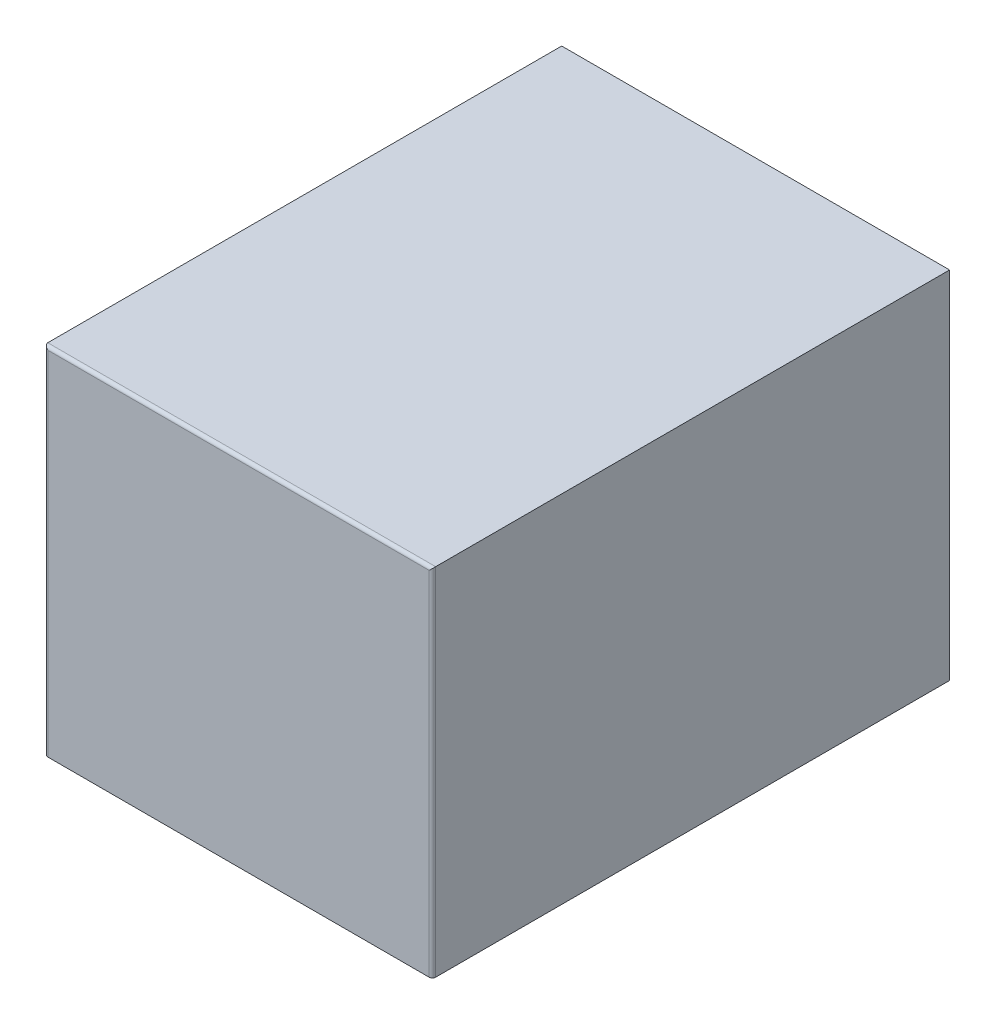
ISO-10303-21;
HEADER;
FILE_DESCRIPTION(('STEP AP214'),'2;1');
FILE_NAME('part.step','',(''),(''),'','','');
FILE_SCHEMA(('AUTOMOTIVE_DESIGN { 1 0 10303 214 1 1 1 1 }'));
ENDSEC;
DATA;
#1=APPLICATION_CONTEXT('core data for automotive mechanical design processes');
#2=APPLICATION_PROTOCOL_DEFINITION('international standard','automotive_design',2000,#1);
#3=PRODUCT_CONTEXT('',#1,'mechanical');
#4=PRODUCT('Part','Part','',(#3));
#5=PRODUCT_RELATED_PRODUCT_CATEGORY('part','',(#4));
#6=PRODUCT_DEFINITION_FORMATION('','',#4);
#7=PRODUCT_DEFINITION_CONTEXT('part definition',#1,'design');
#8=PRODUCT_DEFINITION('design','',#6,#7);
#9=PRODUCT_DEFINITION_SHAPE('','',#8);
#10=(LENGTH_UNIT() NAMED_UNIT(*) SI_UNIT(.MILLI.,.METRE.));
#11=(NAMED_UNIT(*) PLANE_ANGLE_UNIT() SI_UNIT($,.RADIAN.));
#12=(NAMED_UNIT(*) SI_UNIT($,.STERADIAN.) SOLID_ANGLE_UNIT());
#13=UNCERTAINTY_MEASURE_WITH_UNIT(LENGTH_MEASURE(1.E-05),#10,'distance_accuracy_value','');
#14=(GEOMETRIC_REPRESENTATION_CONTEXT(3) GLOBAL_UNCERTAINTY_ASSIGNED_CONTEXT((#13)) GLOBAL_UNIT_ASSIGNED_CONTEXT((#10,
#11,#12)) REPRESENTATION_CONTEXT('',''));
#15=CARTESIAN_POINT('',(0.,0.,0.));
#16=DIRECTION('',(0.,0.,1.));
#17=DIRECTION('',(1.,0.,0.));
#18=AXIS2_PLACEMENT_3D('',#15,#16,#17);
#19=CARTESIAN_POINT('',(0.,0.,3.));
#20=DIRECTION('',(0.,0.,-1.));
#21=DIRECTION('',(-1.,0.,0.));
#22=AXIS2_PLACEMENT_3D('',#19,#20,#21);
#23=PLANE('',#22);
#24=DIRECTION('',(0.,-1.,0.));
#25=VECTOR('',#24,1.);
#26=CARTESIAN_POINT('',(4.94217673369061,7.43294023362127,3.));
#27=LINE('',#26,#25);
#28=CARTESIAN_POINT('',(4.94217673369061,7.43294023362127,3.));
#29=VERTEX_POINT('',#28);
#30=CARTESIAN_POINT('',(4.94217673369061,1.30464108384491,3.));
#31=VERTEX_POINT('',#30);
#32=EDGE_CURVE('E180',#29,#31,#27,.T.);
#33=ORIENTED_EDGE('',*,*,#32,.T.);
#34=DIRECTION('',(-1.,0.,0.));
#35=VECTOR('',#34,1.);
#36=CARTESIAN_POINT('',(4.94217673369061,1.30464108384491,3.));
#37=LINE('',#36,#35);
#38=CARTESIAN_POINT('',(-5.20575949282078,1.30464108384491,3.));
#39=VERTEX_POINT('',#38);
#40=EDGE_CURVE('E183',#31,#39,#37,.T.);
#41=ORIENTED_EDGE('',*,*,#40,.T.);
#42=DIRECTION('',(0.,1.,0.));
#43=VECTOR('',#42,1.);
#44=CARTESIAN_POINT('',(-5.20575949282078,1.30464108384491,3.));
#45=LINE('',#44,#43);
#46=CARTESIAN_POINT('',(-5.20575949282078,7.43294023362127,3.));
#47=VERTEX_POINT('',#46);
#48=EDGE_CURVE('E187',#39,#47,#45,.T.);
#49=ORIENTED_EDGE('',*,*,#48,.T.);
#50=DIRECTION('',(0.597665098454604,0.801745863780568,0.));
#51=VECTOR('',#50,1.);
#52=CARTESIAN_POINT('',(-5.20575949282078,7.43294023362127,3.));
#53=LINE('',#52,#51);
#54=CARTESIAN_POINT('',(-3.40461063876465,9.8491155256478,3.));
#55=VERTEX_POINT('',#54);
#56=EDGE_CURVE('E190',#47,#55,#53,.T.);
#57=ORIENTED_EDGE('',*,*,#56,.T.);
#58=DIRECTION('',(1.,0.,0.));
#59=VECTOR('',#58,1.);
#60=CARTESIAN_POINT('',(-3.40461063876465,9.8491155256478,3.));
#61=LINE('',#60,#59);
#62=CARTESIAN_POINT('',(3.0092365000694,9.8491155256478,3.));
#63=VERTEX_POINT('',#62);
#64=EDGE_CURVE('E193',#55,#63,#61,.T.);
#65=ORIENTED_EDGE('',*,*,#64,.T.);
#66=DIRECTION('',(0.624695047554424,-0.780868809443031,0.));
#67=VECTOR('',#66,1.);
#68=CARTESIAN_POINT('',(3.0092365000694,9.8491155256478,3.));
#69=LINE('',#68,#67);
#70=EDGE_CURVE('E196',#63,#29,#69,.T.);
#71=ORIENTED_EDGE('',*,*,#70,.T.);
#72=EDGE_LOOP('',(#33,#41,#49,#57,#65,#71));
#73=FACE_BOUND('',#72,.T.);
#74=DIRECTION('',(1.,0.,0.));
#75=VECTOR('',#74,1.);
#76=CARTESIAN_POINT('',(3.14102787963448,7.28204634918754,3.));
#77=LINE('',#76,#75);
#78=CARTESIAN_POINT('',(-3.40461063876465,7.28204634918754,3.));
#79=VERTEX_POINT('',#78);
#80=CARTESIAN_POINT('',(3.14102787963448,7.28204634918754,3.));
#81=VERTEX_POINT('',#80);
#82=EDGE_CURVE('E472',#79,#81,#77,.T.);
#83=ORIENTED_EDGE('',*,*,#82,.F.);
#84=DIRECTION('',(0.,1.,0.));
#85=VECTOR('',#84,1.);
#86=CARTESIAN_POINT('',(-3.40461063876465,7.28204634918754,3.));
#87=LINE('',#86,#85);
#88=CARTESIAN_POINT('',(-3.40461063876465,3.4979479286905,3.));
#89=VERTEX_POINT('',#88);
#90=EDGE_CURVE('E172',#89,#79,#87,.T.);
#91=ORIENTED_EDGE('',*,*,#90,.F.);
#92=DIRECTION('',(-1.,0.,0.));
#93=VECTOR('',#92,1.);
#94=CARTESIAN_POINT('',(3.14102787963448,3.4979479286905,3.));
#95=LINE('',#94,#93);
#96=CARTESIAN_POINT('',(3.14102787963448,3.4979479286905,3.));
#97=VERTEX_POINT('',#96);
#98=EDGE_CURVE('E168',#97,#89,#95,.T.);
#99=ORIENTED_EDGE('',*,*,#98,.F.);
#100=DIRECTION('',(0.,-1.,0.));
#101=VECTOR('',#100,1.);
#102=CARTESIAN_POINT('',(3.14102787963448,7.28204634918754,3.));
#103=LINE('',#102,#101);
#104=EDGE_CURVE('E469',#81,#97,#103,.T.);
#105=ORIENTED_EDGE('',*,*,#104,.F.);
#106=EDGE_LOOP('',(#83,#91,#99,#105));
#107=FACE_BOUND('',#106,.T.);
#108=ADVANCED_FACE('F35',(#73,#107),#23,.T.);
#109=CARTESIAN_POINT('',(6.,11.,-8.));
#110=DIRECTION('',(-1.,0.,0.));
#111=DIRECTION('',(0.,0.,1.));
#112=AXIS2_PLACEMENT_3D('',#109,#110,#111);
#113=PLANE('',#112);
#114=DIRECTION('',(0.,0.,-1.));
#115=VECTOR('',#114,1.);
#116=CARTESIAN_POINT('',(6.,11.,-8.));
#117=LINE('',#116,#115);
#118=CARTESIAN_POINT('',(6.,11.,7.9));
#119=VERTEX_POINT('',#118);
#120=CARTESIAN_POINT('',(6.,11.,-8.));
#121=VERTEX_POINT('',#120);
#122=EDGE_CURVE('E229',#119,#121,#117,.T.);
#123=ORIENTED_EDGE('',*,*,#122,.F.);
#124=DIRECTION('',(0.,-1.,0.));
#125=VECTOR('',#124,1.);
#126=CARTESIAN_POINT('',(6.,11.,7.9));
#127=LINE('',#126,#125);
#128=CARTESIAN_POINT('',(6.,0.,7.9));
#129=VERTEX_POINT('',#128);
#130=EDGE_CURVE('E44',#119,#129,#127,.T.);
#131=ORIENTED_EDGE('',*,*,#130,.T.);
#132=DIRECTION('',(0.,0.,-1.));
#133=VECTOR('',#132,1.);
#134=CARTESIAN_POINT('',(6.,0.,-8.));
#135=LINE('',#134,#133);
#136=CARTESIAN_POINT('',(6.,0.,-8.));
#137=VERTEX_POINT('',#136);
#138=EDGE_CURVE('E218',#129,#137,#135,.T.);
#139=ORIENTED_EDGE('',*,*,#138,.T.);
#140=DIRECTION('',(0.,-1.,0.));
#141=VECTOR('',#140,1.);
#142=CARTESIAN_POINT('',(6.,11.,-8.));
#143=LINE('',#142,#141);
#144=EDGE_CURVE('E247',#121,#137,#143,.T.);
#145=ORIENTED_EDGE('',*,*,#144,.F.);
#146=EDGE_LOOP('',(#123,#131,#139,#145));
#147=FACE_BOUND('',#146,.T.);
#148=ADVANCED_FACE('F266',(#147),#113,.F.);
#149=CARTESIAN_POINT('',(-6.,11.,-8.));
#150=DIRECTION('',(0.,0.,1.));
#151=DIRECTION('',(1.,0.,0.));
#152=AXIS2_PLACEMENT_3D('',#149,#150,#151);
#153=PLANE('',#152);
#154=DIRECTION('',(-1.,0.,0.));
#155=VECTOR('',#154,1.);
#156=CARTESIAN_POINT('',(4.94217673369061,1.30464108384491,-8.));
#157=LINE('',#156,#155);
#158=CARTESIAN_POINT('',(4.94217673369061,1.30464108384491,-8.));
#159=VERTEX_POINT('',#158);
#160=CARTESIAN_POINT('',(-5.20575949282078,1.30464108384491,-8.));
#161=VERTEX_POINT('',#160);
#162=EDGE_CURVE('E202',#159,#161,#157,.T.);
#163=ORIENTED_EDGE('',*,*,#162,.F.);
#164=DIRECTION('',(0.,-1.,0.));
#165=VECTOR('',#164,1.);
#166=CARTESIAN_POINT('',(4.94217673369061,7.43294023362127,-8.));
#167=LINE('',#166,#165);
#168=CARTESIAN_POINT('',(4.94217673369061,7.43294023362127,-8.));
#169=VERTEX_POINT('',#168);
#170=EDGE_CURVE('E200',#169,#159,#167,.T.);
#171=ORIENTED_EDGE('',*,*,#170,.F.);
#172=DIRECTION('',(0.624695047554424,-0.780868809443031,0.));
#173=VECTOR('',#172,1.);
#174=CARTESIAN_POINT('',(3.0092365000694,9.8491155256478,-8.));
#175=LINE('',#174,#173);
#176=CARTESIAN_POINT('',(3.0092365000694,9.8491155256478,-8.));
#177=VERTEX_POINT('',#176);
#178=EDGE_CURVE('E184',#177,#169,#175,.T.);
#179=ORIENTED_EDGE('',*,*,#178,.F.);
#180=DIRECTION('',(1.,0.,0.));
#181=VECTOR('',#180,1.);
#182=CARTESIAN_POINT('',(-3.40461063876465,9.8491155256478,-8.));
#183=LINE('',#182,#181);
#184=CARTESIAN_POINT('',(-3.40461063876465,9.8491155256478,-8.));
#185=VERTEX_POINT('',#184);
#186=EDGE_CURVE('E211',#185,#177,#183,.T.);
#187=ORIENTED_EDGE('',*,*,#186,.F.);
#188=DIRECTION('',(0.597665098454604,0.801745863780568,0.));
#189=VECTOR('',#188,1.);
#190=CARTESIAN_POINT('',(-5.20575949282078,7.43294023362127,-8.));
#191=LINE('',#190,#189);
#192=CARTESIAN_POINT('',(-5.20575949282078,7.43294023362127,-8.));
#193=VERTEX_POINT('',#192);
#194=EDGE_CURVE('E208',#193,#185,#191,.T.);
#195=ORIENTED_EDGE('',*,*,#194,.F.);
#196=DIRECTION('',(0.,1.,0.));
#197=VECTOR('',#196,1.);
#198=CARTESIAN_POINT('',(-5.20575949282078,1.30464108384491,-8.));
#199=LINE('',#198,#197);
#200=EDGE_CURVE('E205',#161,#193,#199,.T.);
#201=ORIENTED_EDGE('',*,*,#200,.F.);
#202=EDGE_LOOP('',(#163,#171,#179,#187,#195,#201));
#203=FACE_BOUND('',#202,.T.);
#204=DIRECTION('',(-1.,0.,0.));
#205=VECTOR('',#204,1.);
#206=CARTESIAN_POINT('',(-6.,0.,-8.));
#207=LINE('',#206,#205);
#208=CARTESIAN_POINT('',(-6.,0.,-8.));
#209=VERTEX_POINT('',#208);
#210=EDGE_CURVE('E238',#137,#209,#207,.T.);
#211=ORIENTED_EDGE('',*,*,#210,.T.);
#212=DIRECTION('',(0.,-1.,0.));
#213=VECTOR('',#212,1.);
#214=CARTESIAN_POINT('',(-6.,11.,-8.));
#215=LINE('',#214,#213);
#216=CARTESIAN_POINT('',(-6.,11.,-8.));
#217=VERTEX_POINT('',#216);
#218=EDGE_CURVE('E236',#217,#209,#215,.T.);
#219=ORIENTED_EDGE('',*,*,#218,.F.);
#220=DIRECTION('',(-1.,0.,0.));
#221=VECTOR('',#220,1.);
#222=CARTESIAN_POINT('',(-6.,11.,-8.));
#223=LINE('',#222,#221);
#224=EDGE_CURVE('E231',#121,#217,#223,.T.);
#225=ORIENTED_EDGE('',*,*,#224,.F.);
#226=ORIENTED_EDGE('',*,*,#144,.T.);
#227=EDGE_LOOP('',(#211,#219,#225,#226));
#228=FACE_BOUND('',#227,.T.);
#229=ADVANCED_FACE('F305',(#203,#228),#153,.F.);
#230=CARTESIAN_POINT('',(-6.,11.,-8.));
#231=DIRECTION('',(1.,0.,0.));
#232=DIRECTION('',(0.,0.,-1.));
#233=AXIS2_PLACEMENT_3D('',#230,#231,#232);
#234=PLANE('',#233);
#235=DIRECTION('',(0.,0.,1.));
#236=VECTOR('',#235,1.);
#237=CARTESIAN_POINT('',(-6.,0.,-8.));
#238=LINE('',#237,#236);
#239=CARTESIAN_POINT('',(-6.,0.,7.9));
#240=VERTEX_POINT('',#239);
#241=EDGE_CURVE('E240',#209,#240,#238,.T.);
#242=ORIENTED_EDGE('',*,*,#241,.T.);
#243=DIRECTION('',(0.,-1.,0.));
#244=VECTOR('',#243,1.);
#245=CARTESIAN_POINT('',(-6.,11.,7.9));
#246=LINE('',#245,#244);
#247=CARTESIAN_POINT('',(-6.,11.,7.9));
#248=VERTEX_POINT('',#247);
#249=EDGE_CURVE('E261',#240,#248,#246,.F.);
#250=ORIENTED_EDGE('',*,*,#249,.T.);
#251=DIRECTION('',(0.,0.,1.));
#252=VECTOR('',#251,1.);
#253=CARTESIAN_POINT('',(-6.,11.,-8.));
#254=LINE('',#253,#252);
#255=EDGE_CURVE('E234',#217,#248,#254,.T.);
#256=ORIENTED_EDGE('',*,*,#255,.F.);
#257=ORIENTED_EDGE('',*,*,#218,.T.);
#258=EDGE_LOOP('',(#242,#250,#256,#257));
#259=FACE_BOUND('',#258,.T.);
#260=ADVANCED_FACE('F286',(#259),#234,.F.);
#261=CARTESIAN_POINT('',(-6.,11.,8.));
#262=DIRECTION('',(0.,0.,-1.));
#263=DIRECTION('',(-1.,0.,0.));
#264=AXIS2_PLACEMENT_3D('',#261,#262,#263);
#265=PLANE('',#264);
#266=DIRECTION('',(1.,0.,0.));
#267=VECTOR('',#266,1.);
#268=CARTESIAN_POINT('',(-6.,10.9,8.));
#269=LINE('',#268,#267);
#270=CARTESIAN_POINT('',(5.9,10.9,8.));
#271=VERTEX_POINT('',#270);
#272=CARTESIAN_POINT('',(-5.9,10.9,8.));
#273=VERTEX_POINT('',#272);
#274=EDGE_CURVE('E250',#271,#273,#269,.F.);
#275=ORIENTED_EDGE('',*,*,#274,.T.);
#276=DIRECTION('',(0.,-1.,0.));
#277=VECTOR('',#276,1.);
#278=CARTESIAN_POINT('',(-5.9,11.,8.));
#279=LINE('',#278,#277);
#280=CARTESIAN_POINT('',(-5.9,0.,8.));
#281=VERTEX_POINT('',#280);
#282=EDGE_CURVE('E254',#273,#281,#279,.T.);
#283=ORIENTED_EDGE('',*,*,#282,.T.);
#284=DIRECTION('',(1.,0.,0.));
#285=VECTOR('',#284,1.);
#286=CARTESIAN_POINT('',(-6.,0.,8.));
#287=LINE('',#286,#285);
#288=CARTESIAN_POINT('',(5.9,0.,8.));
#289=VERTEX_POINT('',#288);
#290=EDGE_CURVE('E232',#281,#289,#287,.T.);
#291=ORIENTED_EDGE('',*,*,#290,.T.);
#292=DIRECTION('',(0.,-1.,0.));
#293=VECTOR('',#292,1.);
#294=CARTESIAN_POINT('',(5.9,11.,8.));
#295=LINE('',#294,#293);
#296=EDGE_CURVE('E252',#289,#271,#295,.F.);
#297=ORIENTED_EDGE('',*,*,#296,.T.);
#298=EDGE_LOOP('',(#275,#283,#291,#297));
#299=FACE_BOUND('',#298,.T.);
#300=ADVANCED_FACE('F280',(#299),#265,.F.);
#301=CARTESIAN_POINT('',(0.,11.,0.));
#302=DIRECTION('',(0.,1.,0.));
#303=DIRECTION('',(0.,0.,1.));
#304=AXIS2_PLACEMENT_3D('',#301,#302,#303);
#305=PLANE('',#304);
#306=ORIENTED_EDGE('',*,*,#255,.T.);
#307=DIRECTION('',(1.,0.,0.));
#308=VECTOR('',#307,1.);
#309=CARTESIAN_POINT('',(6.,11.,7.9));
#310=LINE('',#309,#308);
#311=EDGE_CURVE('E11',#248,#119,#310,.T.);
#312=ORIENTED_EDGE('',*,*,#311,.T.);
#313=ORIENTED_EDGE('',*,*,#122,.T.);
#314=ORIENTED_EDGE('',*,*,#224,.T.);
#315=EDGE_LOOP('',(#306,#312,#313,#314));
#316=FACE_BOUND('',#315,.T.);
#317=ADVANCED_FACE('F334',(#316),#305,.T.);
#318=CARTESIAN_POINT('',(0.,0.,0.));
#319=DIRECTION('',(0.,1.,0.));
#320=DIRECTION('',(0.,0.,1.));
#321=AXIS2_PLACEMENT_3D('',#318,#319,#320);
#322=PLANE('',#321);
#323=ORIENTED_EDGE('',*,*,#290,.F.);
#324=CARTESIAN_POINT('',(-5.9,0.,7.9));
#325=DIRECTION('',(0.,1.,0.));
#326=DIRECTION('',(0.,0.,1.));
#327=AXIS2_PLACEMENT_3D('',#324,#325,#326);
#328=CIRCLE('',#327,0.1);
#329=EDGE_CURVE('E259',#281,#240,#328,.F.);
#330=ORIENTED_EDGE('',*,*,#329,.T.);
#331=ORIENTED_EDGE('',*,*,#241,.F.);
#332=ORIENTED_EDGE('',*,*,#210,.F.);
#333=ORIENTED_EDGE('',*,*,#138,.F.);
#334=CARTESIAN_POINT('',(5.9,0.,7.9));
#335=DIRECTION('',(0.,1.,0.));
#336=DIRECTION('',(0.,0.,1.));
#337=AXIS2_PLACEMENT_3D('',#334,#335,#336);
#338=CIRCLE('',#337,0.1);
#339=EDGE_CURVE('E257',#129,#289,#338,.F.);
#340=ORIENTED_EDGE('',*,*,#339,.T.);
#341=EDGE_LOOP('',(#323,#330,#331,#332,#333,#340));
#342=FACE_BOUND('',#341,.T.);
#343=ADVANCED_FACE('F275',(#342),#322,.F.);
#344=CARTESIAN_POINT('',(4.94217673369061,7.43294023362127,3.));
#345=DIRECTION('',(1.,0.,0.));
#346=DIRECTION('',(0.,0.,-1.));
#347=AXIS2_PLACEMENT_3D('',#344,#345,#346);
#348=PLANE('',#347);
#349=ORIENTED_EDGE('',*,*,#170,.T.);
#350=DIRECTION('',(0.,0.,-1.));
#351=VECTOR('',#350,1.);
#352=CARTESIAN_POINT('',(4.94217673369061,1.30464108384491,3.));
#353=LINE('',#352,#351);
#354=EDGE_CURVE('E199',#31,#159,#353,.T.);
#355=ORIENTED_EDGE('',*,*,#354,.F.);
#356=ORIENTED_EDGE('',*,*,#32,.F.);
#357=DIRECTION('',(0.,0.,-1.));
#358=VECTOR('',#357,1.);
#359=CARTESIAN_POINT('',(4.94217673369061,7.43294023362127,3.));
#360=LINE('',#359,#358);
#361=EDGE_CURVE('E216',#29,#169,#360,.T.);
#362=ORIENTED_EDGE('',*,*,#361,.T.);
#363=EDGE_LOOP('',(#349,#355,#356,#362));
#364=FACE_BOUND('',#363,.T.);
#365=ADVANCED_FACE('F315',(#364),#348,.F.);
#366=CARTESIAN_POINT('',(3.0092365000694,9.8491155256478,3.));
#367=DIRECTION('',(0.780868809443031,0.624695047554424,0.));
#368=DIRECTION('',(-0.624695047554424,0.780868809443031,0.));
#369=AXIS2_PLACEMENT_3D('',#366,#367,#368);
#370=PLANE('',#369);
#371=ORIENTED_EDGE('',*,*,#178,.T.);
#372=ORIENTED_EDGE('',*,*,#361,.F.);
#373=ORIENTED_EDGE('',*,*,#70,.F.);
#374=DIRECTION('',(0.,0.,-1.));
#375=VECTOR('',#374,1.);
#376=CARTESIAN_POINT('',(3.0092365000694,9.8491155256478,3.));
#377=LINE('',#376,#375);
#378=EDGE_CURVE('E219',#63,#177,#377,.T.);
#379=ORIENTED_EDGE('',*,*,#378,.T.);
#380=EDGE_LOOP('',(#371,#372,#373,#379));
#381=FACE_BOUND('',#380,.T.);
#382=ADVANCED_FACE('F311',(#381),#370,.F.);
#383=CARTESIAN_POINT('',(-3.40461063876465,9.8491155256478,3.));
#384=DIRECTION('',(0.,1.,0.));
#385=DIRECTION('',(0.,0.,1.));
#386=AXIS2_PLACEMENT_3D('',#383,#384,#385);
#387=PLANE('',#386);
#388=ORIENTED_EDGE('',*,*,#186,.T.);
#389=ORIENTED_EDGE('',*,*,#378,.F.);
#390=ORIENTED_EDGE('',*,*,#64,.F.);
#391=DIRECTION('',(0.,0.,-1.));
#392=VECTOR('',#391,1.);
#393=CARTESIAN_POINT('',(-3.40461063876465,9.8491155256478,3.));
#394=LINE('',#393,#392);
#395=EDGE_CURVE('E221',#55,#185,#394,.T.);
#396=ORIENTED_EDGE('',*,*,#395,.T.);
#397=EDGE_LOOP('',(#388,#389,#390,#396));
#398=FACE_BOUND('',#397,.T.);
#399=ADVANCED_FACE('F314',(#398),#387,.F.);
#400=CARTESIAN_POINT('',(-5.20575949282078,7.43294023362127,3.));
#401=DIRECTION('',(-0.801745863780568,0.597665098454604,0.));
#402=DIRECTION('',(-0.597665098454604,-0.801745863780568,0.));
#403=AXIS2_PLACEMENT_3D('',#400,#401,#402);
#404=PLANE('',#403);
#405=ORIENTED_EDGE('',*,*,#194,.T.);
#406=ORIENTED_EDGE('',*,*,#395,.F.);
#407=ORIENTED_EDGE('',*,*,#56,.F.);
#408=DIRECTION('',(0.,0.,-1.));
#409=VECTOR('',#408,1.);
#410=CARTESIAN_POINT('',(-5.20575949282078,7.43294023362127,3.));
#411=LINE('',#410,#409);
#412=EDGE_CURVE('E223',#47,#193,#411,.T.);
#413=ORIENTED_EDGE('',*,*,#412,.T.);
#414=EDGE_LOOP('',(#405,#406,#407,#413));
#415=FACE_BOUND('',#414,.T.);
#416=ADVANCED_FACE('F319',(#415),#404,.F.);
#417=CARTESIAN_POINT('',(-5.20575949282078,1.30464108384491,3.));
#418=DIRECTION('',(-1.,0.,0.));
#419=DIRECTION('',(0.,0.,1.));
#420=AXIS2_PLACEMENT_3D('',#417,#418,#419);
#421=PLANE('',#420);
#422=ORIENTED_EDGE('',*,*,#200,.T.);
#423=ORIENTED_EDGE('',*,*,#412,.F.);
#424=ORIENTED_EDGE('',*,*,#48,.F.);
#425=DIRECTION('',(0.,0.,-1.));
#426=VECTOR('',#425,1.);
#427=CARTESIAN_POINT('',(-5.20575949282078,1.30464108384491,3.));
#428=LINE('',#427,#426);
#429=EDGE_CURVE('E225',#39,#161,#428,.T.);
#430=ORIENTED_EDGE('',*,*,#429,.T.);
#431=EDGE_LOOP('',(#422,#423,#424,#430));
#432=FACE_BOUND('',#431,.T.);
#433=ADVANCED_FACE('F323',(#432),#421,.F.);
#434=CARTESIAN_POINT('',(4.94217673369061,1.30464108384491,3.));
#435=DIRECTION('',(0.,-1.,0.));
#436=DIRECTION('',(0.,0.,-1.));
#437=AXIS2_PLACEMENT_3D('',#434,#435,#436);
#438=PLANE('',#437);
#439=ORIENTED_EDGE('',*,*,#162,.T.);
#440=ORIENTED_EDGE('',*,*,#429,.F.);
#441=ORIENTED_EDGE('',*,*,#40,.F.);
#442=ORIENTED_EDGE('',*,*,#354,.T.);
#443=EDGE_LOOP('',(#439,#440,#441,#442));
#444=FACE_BOUND('',#443,.T.);
#445=ADVANCED_FACE('F298',(#444),#438,.F.);
#446=CARTESIAN_POINT('',(5.9,11.,7.9));
#447=DIRECTION('',(0.,-1.,0.));
#448=DIRECTION('',(0.,0.,-1.));
#449=AXIS2_PLACEMENT_3D('',#446,#447,#448);
#450=CYLINDRICAL_SURFACE('',#449,0.1);
#451=ORIENTED_EDGE('',*,*,#339,.F.);
#452=ORIENTED_EDGE('',*,*,#130,.F.);
#453=CARTESIAN_POINT('',(5.9,10.9,7.9));
#454=DIRECTION('',(-0.707106781186547,0.707106781186547,0.));
#455=DIRECTION('',(-0.707106781186547,-0.707106781186547,0.));
#456=AXIS2_PLACEMENT_3D('',#453,#454,#455);
#457=ELLIPSE('',#456,0.14142135623731,0.1);
#458=EDGE_CURVE('E39',#271,#119,#457,.T.);
#459=ORIENTED_EDGE('',*,*,#458,.F.);
#460=ORIENTED_EDGE('',*,*,#296,.F.);
#461=EDGE_LOOP('',(#451,#452,#459,#460));
#462=FACE_BOUND('',#461,.T.);
#463=ADVANCED_FACE('F37',(#462),#450,.T.);
#464=CARTESIAN_POINT('',(0.,10.9,7.9));
#465=DIRECTION('',(-1.,0.,0.));
#466=DIRECTION('',(0.,0.,1.));
#467=AXIS2_PLACEMENT_3D('',#464,#465,#466);
#468=CYLINDRICAL_SURFACE('',#467,0.1);
#469=ORIENTED_EDGE('',*,*,#458,.T.);
#470=ORIENTED_EDGE('',*,*,#311,.F.);
#471=CARTESIAN_POINT('',(-5.9,10.9,7.9));
#472=DIRECTION('',(-0.707106781186547,-0.707106781186547,0.));
#473=DIRECTION('',(-0.707106781186547,0.707106781186547,0.));
#474=AXIS2_PLACEMENT_3D('',#471,#472,#473);
#475=ELLIPSE('',#474,0.14142135623731,0.1);
#476=EDGE_CURVE('E174',#273,#248,#475,.T.);
#477=ORIENTED_EDGE('',*,*,#476,.F.);
#478=ORIENTED_EDGE('',*,*,#274,.F.);
#479=EDGE_LOOP('',(#469,#470,#477,#478));
#480=FACE_BOUND('',#479,.T.);
#481=ADVANCED_FACE('F291',(#480),#468,.T.);
#482=CARTESIAN_POINT('',(-5.9,11.,7.9));
#483=DIRECTION('',(0.,-1.,0.));
#484=DIRECTION('',(0.,0.,-1.));
#485=AXIS2_PLACEMENT_3D('',#482,#483,#484);
#486=CYLINDRICAL_SURFACE('',#485,0.1);
#487=ORIENTED_EDGE('',*,*,#476,.T.);
#488=ORIENTED_EDGE('',*,*,#249,.F.);
#489=ORIENTED_EDGE('',*,*,#329,.F.);
#490=ORIENTED_EDGE('',*,*,#282,.F.);
#491=EDGE_LOOP('',(#487,#488,#489,#490));
#492=FACE_BOUND('',#491,.T.);
#493=ADVANCED_FACE('F289',(#492),#486,.T.);
#494=CARTESIAN_POINT('',(-3.40461063876465,7.28204634918754,-7.));
#495=DIRECTION('',(1.,0.,0.));
#496=DIRECTION('',(0.,0.,-1.));
#497=AXIS2_PLACEMENT_3D('',#494,#495,#496);
#498=PLANE('',#497);
#499=ORIENTED_EDGE('',*,*,#90,.T.);
#500=DIRECTION('',(0.,0.,1.));
#501=VECTOR('',#500,1.);
#502=CARTESIAN_POINT('',(-3.40461063876465,7.28204634918754,-7.));
#503=LINE('',#502,#501);
#504=CARTESIAN_POINT('',(-3.40461063876465,7.28204634918754,-7.));
#505=VERTEX_POINT('',#504);
#506=EDGE_CURVE('E153',#505,#79,#503,.T.);
#507=ORIENTED_EDGE('',*,*,#506,.F.);
#508=DIRECTION('',(0.,1.,0.));
#509=VECTOR('',#508,1.);
#510=CARTESIAN_POINT('',(-3.40461063876465,7.28204634918754,-7.));
#511=LINE('',#510,#509);
#512=CARTESIAN_POINT('',(-3.40461063876465,3.4979479286905,-7.));
#513=VERTEX_POINT('',#512);
#514=EDGE_CURVE('E160',#513,#505,#511,.T.);
#515=ORIENTED_EDGE('',*,*,#514,.F.);
#516=DIRECTION('',(0.,0.,1.));
#517=VECTOR('',#516,1.);
#518=CARTESIAN_POINT('',(-3.40461063876465,3.4979479286905,-7.));
#519=LINE('',#518,#517);
#520=EDGE_CURVE('E467',#513,#89,#519,.T.);
#521=ORIENTED_EDGE('',*,*,#520,.T.);
#522=EDGE_LOOP('',(#499,#507,#515,#521));
#523=FACE_BOUND('',#522,.T.);
#524=ADVANCED_FACE('F170',(#523),#498,.F.);
#525=CARTESIAN_POINT('',(3.14102787963448,7.28204634918754,-7.));
#526=DIRECTION('',(0.,-1.,0.));
#527=DIRECTION('',(0.,0.,-1.));
#528=AXIS2_PLACEMENT_3D('',#525,#526,#527);
#529=PLANE('',#528);
#530=ORIENTED_EDGE('',*,*,#82,.T.);
#531=DIRECTION('',(0.,0.,1.));
#532=VECTOR('',#531,1.);
#533=CARTESIAN_POINT('',(3.14102787963448,7.28204634918754,-7.));
#534=LINE('',#533,#532);
#535=CARTESIAN_POINT('',(3.14102787963448,7.28204634918754,-7.));
#536=VERTEX_POINT('',#535);
#537=EDGE_CURVE('E156',#536,#81,#534,.T.);
#538=ORIENTED_EDGE('',*,*,#537,.F.);
#539=DIRECTION('',(1.,0.,0.));
#540=VECTOR('',#539,1.);
#541=CARTESIAN_POINT('',(3.14102787963448,7.28204634918754,-7.));
#542=LINE('',#541,#540);
#543=EDGE_CURVE('E149',#505,#536,#542,.T.);
#544=ORIENTED_EDGE('',*,*,#543,.F.);
#545=ORIENTED_EDGE('',*,*,#506,.T.);
#546=EDGE_LOOP('',(#530,#538,#544,#545));
#547=FACE_BOUND('',#546,.T.);
#548=ADVANCED_FACE('F151',(#547),#529,.F.);
#549=CARTESIAN_POINT('',(3.14102787963448,7.28204634918754,-7.));
#550=DIRECTION('',(-1.,0.,0.));
#551=DIRECTION('',(0.,0.,1.));
#552=AXIS2_PLACEMENT_3D('',#549,#550,#551);
#553=PLANE('',#552);
#554=ORIENTED_EDGE('',*,*,#104,.T.);
#555=DIRECTION('',(0.,0.,1.));
#556=VECTOR('',#555,1.);
#557=CARTESIAN_POINT('',(3.14102787963448,3.4979479286905,-7.));
#558=LINE('',#557,#556);
#559=CARTESIAN_POINT('',(3.14102787963448,3.4979479286905,-7.));
#560=VERTEX_POINT('',#559);
#561=EDGE_CURVE('E52',#560,#97,#558,.T.);
#562=ORIENTED_EDGE('',*,*,#561,.F.);
#563=DIRECTION('',(0.,-1.,0.));
#564=VECTOR('',#563,1.);
#565=CARTESIAN_POINT('',(3.14102787963448,7.28204634918754,-7.));
#566=LINE('',#565,#564);
#567=EDGE_CURVE('E159',#536,#560,#566,.T.);
#568=ORIENTED_EDGE('',*,*,#567,.F.);
#569=ORIENTED_EDGE('',*,*,#537,.T.);
#570=EDGE_LOOP('',(#554,#562,#568,#569));
#571=FACE_BOUND('',#570,.T.);
#572=ADVANCED_FACE('F437',(#571),#553,.F.);
#573=CARTESIAN_POINT('',(3.14102787963448,3.4979479286905,-7.));
#574=DIRECTION('',(0.,1.,0.));
#575=DIRECTION('',(0.,0.,1.));
#576=AXIS2_PLACEMENT_3D('',#573,#574,#575);
#577=PLANE('',#576);
#578=ORIENTED_EDGE('',*,*,#98,.T.);
#579=ORIENTED_EDGE('',*,*,#520,.F.);
#580=DIRECTION('',(-1.,0.,0.));
#581=VECTOR('',#580,1.);
#582=CARTESIAN_POINT('',(3.14102787963448,3.4979479286905,-7.));
#583=LINE('',#582,#581);
#584=EDGE_CURVE('E164',#560,#513,#583,.T.);
#585=ORIENTED_EDGE('',*,*,#584,.F.);
#586=ORIENTED_EDGE('',*,*,#561,.T.);
#587=EDGE_LOOP('',(#578,#579,#585,#586));
#588=FACE_BOUND('',#587,.T.);
#589=ADVANCED_FACE('F445',(#588),#577,.F.);
#590=CARTESIAN_POINT('',(0.,0.,-7.));
#591=DIRECTION('',(0.,0.,-1.));
#592=DIRECTION('',(-1.,0.,0.));
#593=AXIS2_PLACEMENT_3D('',#590,#591,#592);
#594=PLANE('',#593);
#595=ORIENTED_EDGE('',*,*,#514,.T.);
#596=ORIENTED_EDGE('',*,*,#543,.T.);
#597=ORIENTED_EDGE('',*,*,#567,.T.);
#598=ORIENTED_EDGE('',*,*,#584,.T.);
#599=EDGE_LOOP('',(#595,#596,#597,#598));
#600=FACE_BOUND('',#599,.T.);
#601=ADVANCED_FACE('F163',(#600),#594,.T.);
#602=CLOSED_SHELL('',(#108,#148,#229,#260,#300,#317,#343,#365,#382,#399,#416,#433,#445,#463,
#481,#493,#524,#548,#572,#589,#601));
#603=MANIFOLD_SOLID_BREP('B2',#602);
#604=ADVANCED_BREP_SHAPE_REPRESENTATION('',(#18,#603),#14);
#605=SHAPE_DEFINITION_REPRESENTATION(#9,#604);
ENDSEC;
END-ISO-10303-21;
